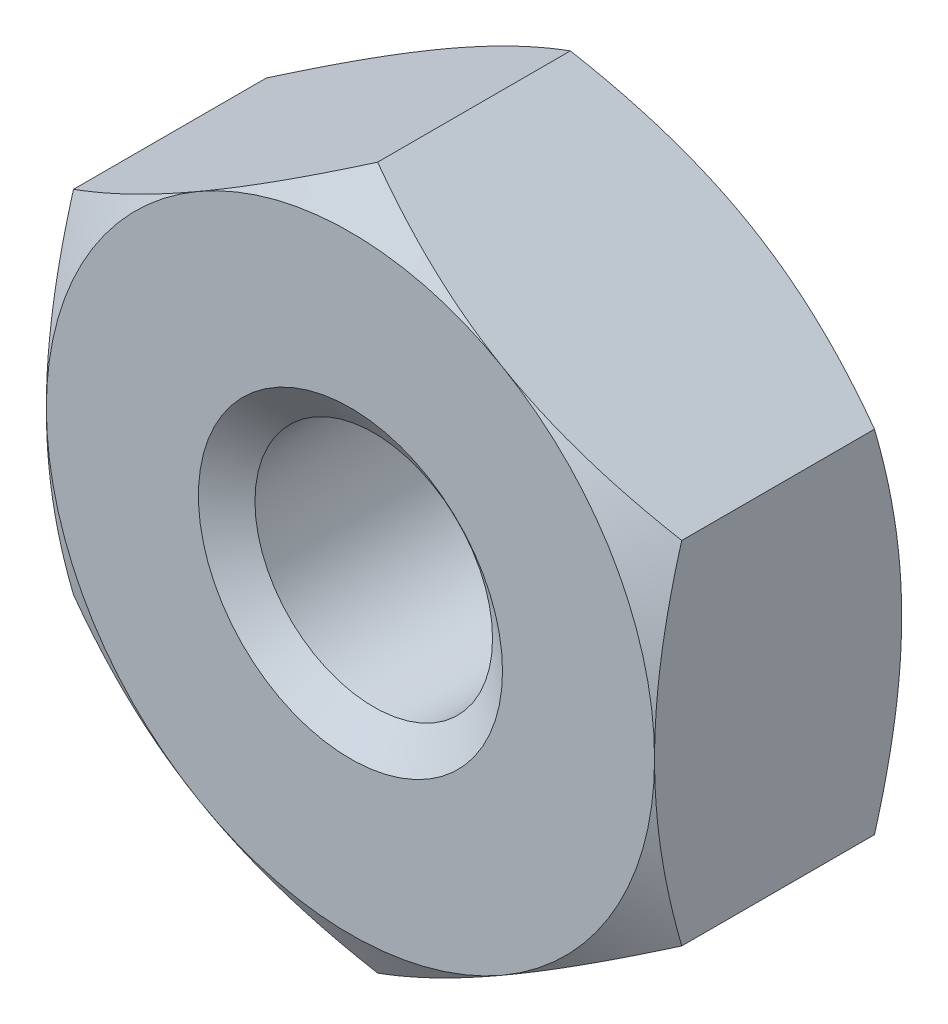
ISO-10303-21;
HEADER;
FILE_DESCRIPTION(('STEP AP214'),'2;1');
FILE_NAME('part.step','',(''),(''),'','','');
FILE_SCHEMA(('AUTOMOTIVE_DESIGN { 1 0 10303 214 1 1 1 1 }'));
ENDSEC;
DATA;
#1=APPLICATION_CONTEXT('core data for automotive mechanical design processes');
#2=APPLICATION_PROTOCOL_DEFINITION('international standard','automotive_design',2000,#1);
#3=PRODUCT_CONTEXT('',#1,'mechanical');
#4=PRODUCT('Part','Part','',(#3));
#5=PRODUCT_RELATED_PRODUCT_CATEGORY('part','',(#4));
#6=PRODUCT_DEFINITION_FORMATION('','',#4);
#7=PRODUCT_DEFINITION_CONTEXT('part definition',#1,'design');
#8=PRODUCT_DEFINITION('design','',#6,#7);
#9=PRODUCT_DEFINITION_SHAPE('','',#8);
#10=(LENGTH_UNIT() NAMED_UNIT(*) SI_UNIT(.MILLI.,.METRE.));
#11=(NAMED_UNIT(*) PLANE_ANGLE_UNIT() SI_UNIT($,.RADIAN.));
#12=(NAMED_UNIT(*) SI_UNIT($,.STERADIAN.) SOLID_ANGLE_UNIT());
#13=UNCERTAINTY_MEASURE_WITH_UNIT(LENGTH_MEASURE(1.E-05),#10,'distance_accuracy_value','');
#14=(GEOMETRIC_REPRESENTATION_CONTEXT(3) GLOBAL_UNCERTAINTY_ASSIGNED_CONTEXT((#13)) GLOBAL_UNIT_ASSIGNED_CONTEXT((#10,
#11,#12)) REPRESENTATION_CONTEXT('',''));
#15=CARTESIAN_POINT('',(0.,0.,0.));
#16=DIRECTION('',(0.,0.,1.));
#17=DIRECTION('',(1.,0.,0.));
#18=AXIS2_PLACEMENT_3D('',#15,#16,#17);
#19=CARTESIAN_POINT('',(0.,0.,-1.3));
#20=DIRECTION('',(0.,0.,1.));
#21=DIRECTION('',(1.,0.,0.));
#22=AXIS2_PLACEMENT_3D('',#19,#20,#21);
#23=CYLINDRICAL_SURFACE('',#22,0.625);
#24=CARTESIAN_POINT('',(0.,0.,-0.122536319186698));
#25=DIRECTION('',(0.,0.,1.));
#26=DIRECTION('',(1.,0.,0.));
#27=AXIS2_PLACEMENT_3D('',#24,#25,#26);
#28=CIRCLE('',#27,0.625);
#29=CARTESIAN_POINT('',(0.625,0.,-0.122536319186698));
#30=VERTEX_POINT('',#29);
#31=EDGE_CURVE('E177',#30,#30,#28,.F.);
#32=ORIENTED_EDGE('',*,*,#31,.F.);
#33=EDGE_LOOP('',(#32));
#34=FACE_BOUND('',#33,.T.);
#35=CARTESIAN_POINT('',(0.,0.,-1.1520636808133));
#36=DIRECTION('',(0.,0.,-1.));
#37=DIRECTION('',(-1.,0.,0.));
#38=AXIS2_PLACEMENT_3D('',#35,#36,#37);
#39=CIRCLE('',#38,0.625);
#40=CARTESIAN_POINT('',(-0.625,0.,-1.1520636808133));
#41=VERTEX_POINT('',#40);
#42=EDGE_CURVE('E41',#41,#41,#39,.F.);
#43=ORIENTED_EDGE('',*,*,#42,.F.);
#44=EDGE_LOOP('',(#43));
#45=FACE_BOUND('',#44,.T.);
#46=ADVANCED_FACE('F36',(#34,#45),#23,.F.);
#47=CARTESIAN_POINT('',(0.,1.84752086140681,-1.3));
#48=DIRECTION('',(-0.500000000000002,0.866025403784438,0.));
#49=DIRECTION('',(-0.866025403784438,-0.500000000000002,0.));
#50=AXIS2_PLACEMENT_3D('',#47,#48,#49);
#51=PLANE('',#50);
#52=DIRECTION('',(0.,0.,1.));
#53=VECTOR('',#52,1.);
#54=CARTESIAN_POINT('',(-1.6,0.9237604307034,-1.3));
#55=LINE('',#54,#53);
#56=CARTESIAN_POINT('',(-1.6,0.923760430703407,-1.15709376403673));
#57=VERTEX_POINT('',#56);
#58=CARTESIAN_POINT('',(-1.6,0.9237604307034,-0.142906235963266));
#59=VERTEX_POINT('',#58);
#60=EDGE_CURVE('E167',#57,#59,#55,.T.);
#61=ORIENTED_EDGE('',*,*,#60,.T.);
#62=CARTESIAN_POINT('',(-1.6002,0.923644960649562,-0.142972908879542));
#63=CARTESIAN_POINT('',(-1.52988631454261,0.9642405858761,-0.11952386935105));
#64=CARTESIAN_POINT('',(-1.45896568981644,1.00518662765285,-0.0981973588558104));
#65=CARTESIAN_POINT('',(-1.31589622208532,1.08778782336023,-0.0609706558641362));
#66=CARTESIAN_POINT('',(-1.24374483580213,1.12944444565323,-0.0450836346469227));
#67=CARTESIAN_POINT('',(-1.10033630057878,1.21224140206853,-0.0203517145647478));
#68=CARTESIAN_POINT('',(-1.02910122444319,1.25336899245115,-0.0113422364016105));
#69=CARTESIAN_POINT('',(-0.886295665767103,1.33581782019457,-0.000584271243997199));
#70=CARTESIAN_POINT('',(-0.814725702734542,1.37713875761731,0.00117312160481502));
#71=CARTESIAN_POINT('',(-0.680978543862273,1.45435771579556,-0.00247117305863181));
#72=CARTESIAN_POINT('',(-0.618781387401735,1.49026726082088,-0.0069780590876114));
#73=CARTESIAN_POINT('',(-0.494792313483936,1.5618523860239,-0.021265876193809));
#74=CARTESIAN_POINT('',(-0.433000825294996,1.59752771836341,-0.0310516940962129));
#75=CARTESIAN_POINT('',(-0.308755841646641,1.66926059311825,-0.0555169113294946));
#76=CARTESIAN_POINT('',(-0.246318081755429,1.70530905059904,-0.07030007992286));
#77=CARTESIAN_POINT('',(-0.122374128162257,1.77686812557048,-0.103852607783291));
#78=CARTESIAN_POINT('',(-0.0608663449577958,1.81237966076083,-0.122614076743966));
#79=CARTESIAN_POINT('',(0.000200000000000133,1.84763633146064,-0.142972908879544));
#80=B_SPLINE_CURVE_WITH_KNOTS('',3,(#62,#63,#64,#65,#66,#67,#68,#69,#70,#71,#72,#73,#74,#75,#76,
#77,#78,#79),.UNSPECIFIED.,.F.,.F.,(4,2,2,2,2,2,2,2,4),(0.,0.253628622662481,0.507867113505243,
0.755812447259193,1.0034532033284,1.21912891721902,1.43500463041921,1.65567058644228,
1.87590291418786),.UNSPECIFIED.);
#81=CARTESIAN_POINT('',(-0.800000000000003,1.3856406460551,0.));
#82=VERTEX_POINT('',#81);
#83=EDGE_CURVE('E63',#59,#82,#80,.T.);
#84=ORIENTED_EDGE('',*,*,#83,.T.);
#85=CARTESIAN_POINT('',(0.,1.84752086140681,-0.142906235963268));
#86=VERTEX_POINT('',#85);
#87=EDGE_CURVE('E246',#82,#86,#80,.T.);
#88=ORIENTED_EDGE('',*,*,#87,.T.);
#89=DIRECTION('',(0.,0.,1.));
#90=VECTOR('',#89,1.);
#91=CARTESIAN_POINT('',(0.,1.84752086140681,-1.3));
#92=LINE('',#91,#90);
#93=CARTESIAN_POINT('',(0.,1.84752086140681,-1.15709376403673));
#94=VERTEX_POINT('',#93);
#95=EDGE_CURVE('E152',#94,#86,#92,.T.);
#96=ORIENTED_EDGE('',*,*,#95,.F.);
#97=CARTESIAN_POINT('',(-1.6002,0.923644960649562,-1.15702709112046));
#98=CARTESIAN_POINT('',(-1.52988631454261,0.9642405858761,-1.18047613064895));
#99=CARTESIAN_POINT('',(-1.45896568981644,1.00518662765285,-1.20180264114419));
#100=CARTESIAN_POINT('',(-1.31589622208532,1.08778782336023,-1.23902934413586));
#101=CARTESIAN_POINT('',(-1.24374483580213,1.12944444565323,-1.25491636535308));
#102=CARTESIAN_POINT('',(-1.10033630057878,1.21224140206853,-1.27964828543525));
#103=CARTESIAN_POINT('',(-1.02910122444319,1.25336899245115,-1.28865776359839));
#104=CARTESIAN_POINT('',(-0.886295665767103,1.33581782019457,-1.299415728756));
#105=CARTESIAN_POINT('',(-0.814725702734541,1.37713875761731,-1.30117312160482));
#106=CARTESIAN_POINT('',(-0.680978543862273,1.45435771579556,-1.29752882694137));
#107=CARTESIAN_POINT('',(-0.618781387401735,1.49026726082088,-1.29302194091239));
#108=CARTESIAN_POINT('',(-0.494792313483936,1.5618523860239,-1.27873412380619));
#109=CARTESIAN_POINT('',(-0.433000825294996,1.59752771836341,-1.26894830590379));
#110=CARTESIAN_POINT('',(-0.308755841646641,1.66926059311825,-1.24448308867051));
#111=CARTESIAN_POINT('',(-0.246318081755429,1.70530905059904,-1.22969992007714));
#112=CARTESIAN_POINT('',(-0.122374128162257,1.77686812557048,-1.19614739221671));
#113=CARTESIAN_POINT('',(-0.0608663449577957,1.81237966076083,-1.17738592325603));
#114=CARTESIAN_POINT('',(0.00019999999999997,1.84763633146064,-1.15702709112046));
#115=B_SPLINE_CURVE_WITH_KNOTS('',3,(#97,#98,#99,#100,#101,#102,#103,#104,#105,#106,#107,#108,
#109,#110,#111,#112,#113,#114),.UNSPECIFIED.,.F.,.F.,(4,2,2,2,2,2,2,2,4),(0.,0.25362862266248,
0.507867113505243,0.755812447259193,1.00345320332839,1.21912891721902,1.43500463041921,
1.65567058644228,1.87590291418786),.UNSPECIFIED.);
#116=CARTESIAN_POINT('',(-0.800000000000003,1.3856406460551,-1.3));
#117=VERTEX_POINT('',#116);
#118=EDGE_CURVE('E170',#117,#94,#115,.T.);
#119=ORIENTED_EDGE('',*,*,#118,.F.);
#120=EDGE_CURVE('E269',#57,#117,#115,.T.);
#121=ORIENTED_EDGE('',*,*,#120,.F.);
#122=EDGE_LOOP('',(#61,#84,#88,#96,#119,#121));
#123=FACE_BOUND('',#122,.T.);
#124=ADVANCED_FACE('F38',(#123),#51,.T.);
#125=CARTESIAN_POINT('',(1.6,0.923760430703399,-1.3));
#126=DIRECTION('',(0.500000000000002,0.866025403784437,0.));
#127=DIRECTION('',(-0.866025403784437,0.500000000000002,0.));
#128=AXIS2_PLACEMENT_3D('',#125,#126,#127);
#129=PLANE('',#128);
#130=ORIENTED_EDGE('',*,*,#95,.T.);
#131=CARTESIAN_POINT('',(-0.000199999999999719,1.84763633146064,-0.142972908879544));
#132=CARTESIAN_POINT('',(0.0701136854573882,1.80704070623411,-0.119523869351051));
#133=CARTESIAN_POINT('',(0.14103431018356,1.76609466445735,-0.0981973588558121));
#134=CARTESIAN_POINT('',(0.284103777914678,1.68349346874998,-0.0609706558641375));
#135=CARTESIAN_POINT('',(0.356255164197867,1.64183684645697,-0.0450836346469238));
#136=CARTESIAN_POINT('',(0.499663699421224,1.55903989004168,-0.0203517145647484));
#137=CARTESIAN_POINT('',(0.570898775556808,1.51791229965905,-0.0113422364016109));
#138=CARTESIAN_POINT('',(0.713704334232898,1.43546347191564,-0.000584271243997234));
#139=CARTESIAN_POINT('',(0.78527429726546,1.3941425344929,0.0011731216048152));
#140=CARTESIAN_POINT('',(0.919021456137728,1.31692357631464,-0.00247117305863137));
#141=CARTESIAN_POINT('',(0.981218612598266,1.28101403128932,-0.00697805908761087));
#142=CARTESIAN_POINT('',(1.10520768651606,1.20942890608631,-0.0212658761938082));
#143=CARTESIAN_POINT('',(1.166999174705,1.1737535737468,-0.0310516940962118));
#144=CARTESIAN_POINT('',(1.29124415835336,1.10202069899196,-0.0555169113294932));
#145=CARTESIAN_POINT('',(1.35368191824457,1.06597224151117,-0.0703000799228585));
#146=CARTESIAN_POINT('',(1.47762587183774,0.994413166539724,-0.103852607783289));
#147=CARTESIAN_POINT('',(1.5391336550422,0.958901631349371,-0.122614076743964));
#148=CARTESIAN_POINT('',(1.6002,0.923644960649561,-0.142972908879541));
#149=B_SPLINE_CURVE_WITH_KNOTS('',3,(#131,#132,#133,#134,#135,#136,#137,#138,#139,#140,#141,
#142,#143,#144,#145,#146,#147,#148),.UNSPECIFIED.,.F.,.F.,(4,2,2,2,2,2,2,2,4),(0.,
0.253628622662481,0.507867113505244,0.755812447259195,1.0034532033284,1.21912891721902,
1.43500463041921,1.65567058644228,1.87590291418786),.UNSPECIFIED.);
#150=CARTESIAN_POINT('',(0.800000000000003,1.3856406460551,0.));
#151=VERTEX_POINT('',#150);
#152=EDGE_CURVE('E145',#86,#151,#149,.T.);
#153=ORIENTED_EDGE('',*,*,#152,.T.);
#154=CARTESIAN_POINT('',(1.6,0.923760430703407,-0.142906235963268));
#155=VERTEX_POINT('',#154);
#156=EDGE_CURVE('E131',#151,#155,#149,.T.);
#157=ORIENTED_EDGE('',*,*,#156,.T.);
#158=DIRECTION('',(0.,0.,1.));
#159=VECTOR('',#158,1.);
#160=CARTESIAN_POINT('',(1.6,0.923760430703399,-1.3));
#161=LINE('',#160,#159);
#162=CARTESIAN_POINT('',(1.6,0.923760430703407,-1.15709376403673));
#163=VERTEX_POINT('',#162);
#164=EDGE_CURVE('E144',#163,#155,#161,.T.);
#165=ORIENTED_EDGE('',*,*,#164,.F.);
#166=CARTESIAN_POINT('',(-0.000199999999999719,1.84763633146064,-1.15702709112046));
#167=CARTESIAN_POINT('',(0.0701136854573882,1.80704070623411,-1.18047613064895));
#168=CARTESIAN_POINT('',(0.14103431018356,1.76609466445735,-1.20180264114419));
#169=CARTESIAN_POINT('',(0.284103777914678,1.68349346874998,-1.23902934413586));
#170=CARTESIAN_POINT('',(0.356255164197867,1.64183684645697,-1.25491636535308));
#171=CARTESIAN_POINT('',(0.499663699421224,1.55903989004168,-1.27964828543525));
#172=CARTESIAN_POINT('',(0.570898775556808,1.51791229965905,-1.28865776359839));
#173=CARTESIAN_POINT('',(0.713704334232898,1.43546347191564,-1.299415728756));
#174=CARTESIAN_POINT('',(0.78527429726546,1.3941425344929,-1.30117312160482));
#175=CARTESIAN_POINT('',(0.919021456137728,1.31692357631464,-1.29752882694137));
#176=CARTESIAN_POINT('',(0.981218612598266,1.28101403128932,-1.29302194091239));
#177=CARTESIAN_POINT('',(1.10520768651606,1.20942890608631,-1.27873412380619));
#178=CARTESIAN_POINT('',(1.166999174705,1.1737535737468,-1.26894830590379));
#179=CARTESIAN_POINT('',(1.29124415835336,1.10202069899196,-1.24448308867051));
#180=CARTESIAN_POINT('',(1.35368191824457,1.06597224151117,-1.22969992007714));
#181=CARTESIAN_POINT('',(1.47762587183774,0.994413166539724,-1.19614739221671));
#182=CARTESIAN_POINT('',(1.5391336550422,0.958901631349371,-1.17738592325604));
#183=CARTESIAN_POINT('',(1.6002,0.923644960649561,-1.15702709112046));
#184=B_SPLINE_CURVE_WITH_KNOTS('',3,(#166,#167,#168,#169,#170,#171,#172,#173,#174,#175,#176,
#177,#178,#179,#180,#181,#182,#183),.UNSPECIFIED.,.F.,.F.,(4,2,2,2,2,2,2,2,4),(0.,
0.253628622662481,0.507867113505244,0.755812447259195,1.0034532033284,1.21912891721902,
1.43500463041921,1.65567058644228,1.87590291418786),.UNSPECIFIED.);
#185=CARTESIAN_POINT('',(0.800000000000003,1.3856406460551,-1.3));
#186=VERTEX_POINT('',#185);
#187=EDGE_CURVE('E262',#186,#163,#184,.T.);
#188=ORIENTED_EDGE('',*,*,#187,.F.);
#189=EDGE_CURVE('E268',#94,#186,#184,.T.);
#190=ORIENTED_EDGE('',*,*,#189,.F.);
#191=EDGE_LOOP('',(#130,#153,#157,#165,#188,#190));
#192=FACE_BOUND('',#191,.T.);
#193=ADVANCED_FACE('F142',(#192),#129,.T.);
#194=CARTESIAN_POINT('',(1.6,0.923760430703399,-1.3));
#195=DIRECTION('',(-1.,0.,0.));
#196=DIRECTION('',(0.,0.,1.));
#197=AXIS2_PLACEMENT_3D('',#194,#195,#196);
#198=PLANE('',#197);
#199=CARTESIAN_POINT('',(1.6,-2.44994879598357,-0.765642728496259));
#200=CARTESIAN_POINT('',(1.6,-2.37969974814163,-0.731694508327918));
#201=CARTESIAN_POINT('',(1.6,-2.30928460837461,-0.698083761533541));
#202=CARTESIAN_POINT('',(1.6,-2.16803233911836,-0.631730058708288));
#203=CARTESIAN_POINT('',(1.6,-2.09719513913279,-0.598987252925733));
#204=CARTESIAN_POINT('',(1.6,-1.95462628673218,-0.534389785244709));
#205=CARTESIAN_POINT('',(1.6,-1.8828918355113,-0.502541278099893));
#206=CARTESIAN_POINT('',(1.6,-1.73883333903521,-0.44021223409345));
#207=CARTESIAN_POINT('',(1.6,-1.6665093247456,-0.409731625925813));
#208=CARTESIAN_POINT('',(1.6,-1.52025911131041,-0.350140376362839));
#209=CARTESIAN_POINT('',(1.6,-1.44632414246222,-0.321051139719715));
#210=CARTESIAN_POINT('',(1.6,-1.29758156645315,-0.265150698697263));
#211=CARTESIAN_POINT('',(1.6,-1.22277385663729,-0.238339765436293));
#212=CARTESIAN_POINT('',(1.6,-1.07232436571228,-0.187717744432215));
#213=CARTESIAN_POINT('',(1.6,-0.996684796742377,-0.16390014938712));
#214=CARTESIAN_POINT('',(1.6,-0.844324154022591,-0.120034982590466));
#215=CARTESIAN_POINT('',(1.6,-0.767603338043493,-0.0999865280833133));
#216=CARTESIAN_POINT('',(1.6,-0.613036885171955,-0.0646363619078523));
#217=CARTESIAN_POINT('',(1.6,-0.535190999347726,-0.0493357180986316));
#218=CARTESIAN_POINT('',(1.6,-0.378561259128046,-0.0245095306527775));
#219=CARTESIAN_POINT('',(1.6,-0.299777403903375,-0.014983992122063));
#220=CARTESIAN_POINT('',(1.6,-0.142180170377903,-0.00255333229477223));
#221=CARTESIAN_POINT('',(1.6,-0.0633701971665525,0.000393701552479175));
#222=CARTESIAN_POINT('',(1.6,0.094186507576113,-0.000479368384373142));
#223=CARTESIAN_POINT('',(1.6,0.172933250213998,-0.00429771555629648));
#224=CARTESIAN_POINT('',(1.6,0.363437778602548,-0.0213794511304662));
#225=CARTESIAN_POINT('',(1.6,0.474896382255892,-0.0379863535114732));
#226=CARTESIAN_POINT('',(1.6,0.695751445002752,-0.0817595954163211));
#227=CARTESIAN_POINT('',(1.6,0.805145318543973,-0.108938358499321));
#228=CARTESIAN_POINT('',(1.6,0.968869652923254,-0.15580715652431));
#229=CARTESIAN_POINT('',(1.6,1.02403724151603,-0.172685741626058));
#230=CARTESIAN_POINT('',(1.6,1.13379353971654,-0.208113667302656));
#231=CARTESIAN_POINT('',(1.6,1.18838261996598,-0.226661855504924));
#232=CARTESIAN_POINT('',(1.6,1.29675750604283,-0.265042326377577));
#233=CARTESIAN_POINT('',(1.6,1.35054610375004,-0.284866793658882));
#234=CARTESIAN_POINT('',(1.6,1.45770597270107,-0.325679318149291));
#235=CARTESIAN_POINT('',(1.6,1.51107706518851,-0.346667845641859));
#236=CARTESIAN_POINT('',(1.6,1.56425479594673,-0.368123602616716));
#237=B_SPLINE_CURVE_WITH_KNOTS('',3,(#199,#200,#201,#202,#203,#204,#205,#206,#207,#208,#209,
#210,#211,#212,#213,#214,#215,#216,#217,#218,#219,#220,#221,#222,#223,#224,#225,#226,#227,#228,
#229,#230,#231,#232,#233,#234,#235,#236),.UNSPECIFIED.,.F.,.F.,(4,2,2,2,2,2,2,2,2,2,2,2,2,2,2,2,
2,2,4),(0.,0.234068717012908,0.468177692239707,0.703626378583959,0.939062777139307,
1.17738868236875,1.41574290880726,1.65356966173644,1.89134064461681,2.12916506732231,
2.36698970029418,2.60329474246707,2.83953843769047,3.1769134235551,3.51468608047105,
3.68774124262249,3.86067786349693,4.03264108088362,4.20467428524161),.UNSPECIFIED.);
#238=CARTESIAN_POINT('',(1.6,-0.923760430703406,-0.142906235963268));
#239=VERTEX_POINT('',#238);
#240=CARTESIAN_POINT('',(1.6,0.,0.));
#241=VERTEX_POINT('',#240);
#242=EDGE_CURVE('E137',#239,#241,#237,.T.);
#243=ORIENTED_EDGE('',*,*,#242,.F.);
#244=DIRECTION('',(0.,0.,1.));
#245=VECTOR('',#244,1.);
#246=CARTESIAN_POINT('',(1.6,-0.923760430703406,-1.3));
#247=LINE('',#246,#245);
#248=CARTESIAN_POINT('',(1.6,-0.923760430703406,-1.15709376403673));
#249=VERTEX_POINT('',#248);
#250=EDGE_CURVE('E153',#249,#239,#247,.T.);
#251=ORIENTED_EDGE('',*,*,#250,.F.);
#252=CARTESIAN_POINT('',(1.6,-2.44994879598357,-0.53435727150374));
#253=CARTESIAN_POINT('',(1.6,-2.37969974814163,-0.568305491672082));
#254=CARTESIAN_POINT('',(1.6,-2.30928460837461,-0.601916238466459));
#255=CARTESIAN_POINT('',(1.6,-2.16803233911836,-0.668269941291711));
#256=CARTESIAN_POINT('',(1.6,-2.09719513913279,-0.701012747074267));
#257=CARTESIAN_POINT('',(1.6,-1.95462628673218,-0.765610214755291));
#258=CARTESIAN_POINT('',(1.6,-1.8828918355113,-0.797458721900106));
#259=CARTESIAN_POINT('',(1.6,-1.73883333903521,-0.85978776590655));
#260=CARTESIAN_POINT('',(1.6,-1.6665093247456,-0.890268374074187));
#261=CARTESIAN_POINT('',(1.6,-1.52025911131041,-0.94985962363716));
#262=CARTESIAN_POINT('',(1.6,-1.44632414246222,-0.978948860280285));
#263=CARTESIAN_POINT('',(1.6,-1.29758156645315,-1.03484930130274));
#264=CARTESIAN_POINT('',(1.6,-1.22277385663729,-1.06166023456371));
#265=CARTESIAN_POINT('',(1.6,-1.07232436571228,-1.11228225556778));
#266=CARTESIAN_POINT('',(1.6,-0.996684796742377,-1.13609985061288));
#267=CARTESIAN_POINT('',(1.6,-0.844324154022591,-1.17996501740953));
#268=CARTESIAN_POINT('',(1.6,-0.767603338043493,-1.20001347191669));
#269=CARTESIAN_POINT('',(1.6,-0.613036885171955,-1.23536363809215));
#270=CARTESIAN_POINT('',(1.6,-0.535190999347727,-1.25066428190137));
#271=CARTESIAN_POINT('',(1.6,-0.378561259128047,-1.27549046934722));
#272=CARTESIAN_POINT('',(1.6,-0.299777403903376,-1.28501600787794));
#273=CARTESIAN_POINT('',(1.6,-0.142180170377903,-1.29744666770523));
#274=CARTESIAN_POINT('',(1.6,-0.0633701971665525,-1.30039370155248));
#275=CARTESIAN_POINT('',(1.6,0.0941865075761131,-1.29952063161563));
#276=CARTESIAN_POINT('',(1.6,0.172933250213998,-1.2957022844437));
#277=CARTESIAN_POINT('',(1.6,0.363437778602548,-1.27862054886953));
#278=CARTESIAN_POINT('',(1.6,0.474896382255892,-1.26201364648853));
#279=CARTESIAN_POINT('',(1.6,0.695751445002752,-1.21824040458368));
#280=CARTESIAN_POINT('',(1.6,0.805145318543973,-1.19106164150068));
#281=CARTESIAN_POINT('',(1.6,0.968869652923254,-1.14419284347569));
#282=CARTESIAN_POINT('',(1.6,1.02403724151603,-1.12731425837394));
#283=CARTESIAN_POINT('',(1.6,1.13379353971654,-1.09188633269734));
#284=CARTESIAN_POINT('',(1.6,1.18838261996598,-1.07333814449508));
#285=CARTESIAN_POINT('',(1.6,1.29675750604283,-1.03495767362242));
#286=CARTESIAN_POINT('',(1.6,1.35054610375004,-1.01513320634112));
#287=CARTESIAN_POINT('',(1.6,1.45770597270107,-0.974320681850709));
#288=CARTESIAN_POINT('',(1.6,1.51107706518851,-0.953332154358141));
#289=CARTESIAN_POINT('',(1.6,1.56425479594673,-0.931876397383284));
#290=B_SPLINE_CURVE_WITH_KNOTS('',3,(#252,#253,#254,#255,#256,#257,#258,#259,#260,#261,#262,
#263,#264,#265,#266,#267,#268,#269,#270,#271,#272,#273,#274,#275,#276,#277,#278,#279,#280,#281,
#282,#283,#284,#285,#286,#287,#288,#289),.UNSPECIFIED.,.F.,.F.,(4,2,2,2,2,2,2,2,2,2,2,2,2,2,2,2,
2,2,4),(0.,0.234068717012908,0.468177692239707,0.703626378583959,0.939062777139307,
1.17738868236875,1.41574290880726,1.65356966173644,1.89134064461681,2.1291650673223,
2.36698970029418,2.60329474246707,2.83953843769047,3.17691342355509,3.51468608047105,
3.68774124262249,3.86067786349692,4.03264108088362,4.20467428524161),.UNSPECIFIED.);
#291=CARTESIAN_POINT('',(1.6,0.,-1.3));
#292=VERTEX_POINT('',#291);
#293=EDGE_CURVE('E275',#249,#292,#290,.T.);
#294=ORIENTED_EDGE('',*,*,#293,.T.);
#295=EDGE_CURVE('E151',#292,#163,#290,.T.);
#296=ORIENTED_EDGE('',*,*,#295,.T.);
#297=ORIENTED_EDGE('',*,*,#164,.T.);
#298=EDGE_CURVE('E128',#241,#155,#237,.T.);
#299=ORIENTED_EDGE('',*,*,#298,.F.);
#300=EDGE_LOOP('',(#243,#251,#294,#296,#297,#299));
#301=FACE_BOUND('',#300,.T.);
#302=ADVANCED_FACE('F148',(#301),#198,.F.);
#303=CARTESIAN_POINT('',(0.,-1.84752086140681,-1.3));
#304=DIRECTION('',(0.500000000000002,-0.866025403784438,0.));
#305=DIRECTION('',(0.866025403784438,0.500000000000002,0.));
#306=AXIS2_PLACEMENT_3D('',#303,#304,#305);
#307=PLANE('',#306);
#308=ORIENTED_EDGE('',*,*,#250,.T.);
#309=CARTESIAN_POINT('',(1.6002,-0.923644960649568,-0.142972908879543));
#310=CARTESIAN_POINT('',(1.52988631454261,-0.964240585876105,-0.119523869351051));
#311=CARTESIAN_POINT('',(1.45896568981644,-1.00518662765286,-0.0981973588558121));
#312=CARTESIAN_POINT('',(1.31589622208532,-1.08778782336023,-0.0609706558641381));
#313=CARTESIAN_POINT('',(1.24374483580213,-1.12944444565324,-0.0450836346469248));
#314=CARTESIAN_POINT('',(1.10033630057878,-1.21224140206853,-0.0203517145647502));
#315=CARTESIAN_POINT('',(1.02910122444319,-1.25336899245116,-0.011342236401613));
#316=CARTESIAN_POINT('',(0.886295665767102,-1.33581782019457,-0.000584271243999939));
#317=CARTESIAN_POINT('',(0.81472570273454,-1.37713875761732,0.00117312160481225));
#318=CARTESIAN_POINT('',(0.680978543862272,-1.45435771579557,-0.00247117305863489));
#319=CARTESIAN_POINT('',(0.618781387401734,-1.49026726082089,-0.00697805908761471));
#320=CARTESIAN_POINT('',(0.494792313483935,-1.5618523860239,-0.0212658761938125));
#321=CARTESIAN_POINT('',(0.433000825294995,-1.59752771836341,-0.0310516940962164));
#322=CARTESIAN_POINT('',(0.30875584164664,-1.66926059311825,-0.0555169113294982));
#323=CARTESIAN_POINT('',(0.246318081755429,-1.70530905059904,-0.0703000799228637));
#324=CARTESIAN_POINT('',(0.122374128162257,-1.77686812557049,-0.103852607783295));
#325=CARTESIAN_POINT('',(0.0608663449577954,-1.81237966076084,-0.122614076743969));
#326=CARTESIAN_POINT('',(-0.00020000000000018,-1.84763633146065,-0.142972908879547));
#327=B_SPLINE_CURVE_WITH_KNOTS('',3,(#309,#310,#311,#312,#313,#314,#315,#316,#317,#318,#319,
#320,#321,#322,#323,#324,#325,#326),.UNSPECIFIED.,.F.,.F.,(4,2,2,2,2,2,2,2,4),(0.,
0.253628622662481,0.507867113505244,0.755812447259194,1.0034532033284,1.21912891721902,
1.43500463041921,1.65567058644228,1.87590291418786),.UNSPECIFIED.);
#328=CARTESIAN_POINT('',(0.800000000000003,-1.3856406460551,0.));
#329=VERTEX_POINT('',#328);
#330=EDGE_CURVE('E550',#239,#329,#327,.T.);
#331=ORIENTED_EDGE('',*,*,#330,.T.);
#332=CARTESIAN_POINT('',(0.,-1.84752086140681,-0.142906235963268));
#333=VERTEX_POINT('',#332);
#334=EDGE_CURVE('E230',#329,#333,#327,.T.);
#335=ORIENTED_EDGE('',*,*,#334,.T.);
#336=DIRECTION('',(0.,0.,1.));
#337=VECTOR('',#336,1.);
#338=CARTESIAN_POINT('',(0.,-1.84752086140681,-1.3));
#339=LINE('',#338,#337);
#340=CARTESIAN_POINT('',(0.,-1.84752086140681,-1.15709376403673));
#341=VERTEX_POINT('',#340);
#342=EDGE_CURVE('E158',#341,#333,#339,.T.);
#343=ORIENTED_EDGE('',*,*,#342,.F.);
#344=CARTESIAN_POINT('',(1.6002,-0.923644960649568,-1.15702709112046));
#345=CARTESIAN_POINT('',(1.52988631454261,-0.964240585876105,-1.18047613064895));
#346=CARTESIAN_POINT('',(1.45896568981644,-1.00518662765286,-1.20180264114419));
#347=CARTESIAN_POINT('',(1.31589622208532,-1.08778782336024,-1.23902934413586));
#348=CARTESIAN_POINT('',(1.24374483580213,-1.12944444565324,-1.25491636535308));
#349=CARTESIAN_POINT('',(1.10033630057878,-1.21224140206854,-1.27964828543525));
#350=CARTESIAN_POINT('',(1.02910122444319,-1.25336899245116,-1.28865776359839));
#351=CARTESIAN_POINT('',(0.886295665767102,-1.33581782019457,-1.299415728756));
#352=CARTESIAN_POINT('',(0.81472570273454,-1.37713875761732,-1.30117312160481));
#353=CARTESIAN_POINT('',(0.680978543862272,-1.45435771579557,-1.29752882694136));
#354=CARTESIAN_POINT('',(0.618781387401734,-1.49026726082089,-1.29302194091239));
#355=CARTESIAN_POINT('',(0.494792313483935,-1.5618523860239,-1.27873412380619));
#356=CARTESIAN_POINT('',(0.433000825294995,-1.59752771836341,-1.26894830590378));
#357=CARTESIAN_POINT('',(0.30875584164664,-1.66926059311825,-1.2444830886705));
#358=CARTESIAN_POINT('',(0.246318081755429,-1.70530905059904,-1.22969992007714));
#359=CARTESIAN_POINT('',(0.122374128162257,-1.77686812557049,-1.19614739221671));
#360=CARTESIAN_POINT('',(0.0608663449577955,-1.81237966076084,-1.17738592325603));
#361=CARTESIAN_POINT('',(-0.000200000000000114,-1.84763633146065,-1.15702709112045));
#362=B_SPLINE_CURVE_WITH_KNOTS('',3,(#344,#345,#346,#347,#348,#349,#350,#351,#352,#353,#354,
#355,#356,#357,#358,#359,#360,#361),.UNSPECIFIED.,.F.,.F.,(4,2,2,2,2,2,2,2,4),(0.,
0.253628622662481,0.507867113505244,0.755812447259195,1.0034532033284,1.21912891721902,
1.43500463041921,1.65567058644228,1.87590291418786),.UNSPECIFIED.);
#363=CARTESIAN_POINT('',(0.800000000000003,-1.3856406460551,-1.3));
#364=VERTEX_POINT('',#363);
#365=EDGE_CURVE('E282',#364,#341,#362,.T.);
#366=ORIENTED_EDGE('',*,*,#365,.F.);
#367=EDGE_CURVE('E281',#249,#364,#362,.T.);
#368=ORIENTED_EDGE('',*,*,#367,.F.);
#369=EDGE_LOOP('',(#308,#331,#335,#343,#366,#368));
#370=FACE_BOUND('',#369,.T.);
#371=ADVANCED_FACE('F294',(#370),#307,.T.);
#372=CARTESIAN_POINT('',(-1.6,-0.923760430703405,-1.3));
#373=DIRECTION('',(-0.500000000000002,-0.866025403784437,0.));
#374=DIRECTION('',(0.866025403784437,-0.500000000000002,0.));
#375=AXIS2_PLACEMENT_3D('',#372,#373,#374);
#376=PLANE('',#375);
#377=ORIENTED_EDGE('',*,*,#342,.T.);
#378=CARTESIAN_POINT('',(0.000199999999999844,-1.84763633146065,-0.142972908879547));
#379=CARTESIAN_POINT('',(-0.0701136854573883,-1.80704070623411,-0.119523869351055));
#380=CARTESIAN_POINT('',(-0.14103431018356,-1.76609466445736,-0.0981973588558154));
#381=CARTESIAN_POINT('',(-0.284103777914678,-1.68349346874998,-0.0609706558641407));
#382=CARTESIAN_POINT('',(-0.356255164197868,-1.64183684645698,-0.045083634646927));
#383=CARTESIAN_POINT('',(-0.499663699421225,-1.55903989004168,-0.0203517145647515));
#384=CARTESIAN_POINT('',(-0.570898775556809,-1.51791229965906,-0.011342236401614));
#385=CARTESIAN_POINT('',(-0.7137043342329,-1.43546347191564,-0.000584271244000196));
#386=CARTESIAN_POINT('',(-0.785274297265462,-1.3941425344929,0.0011731216048123));
#387=CARTESIAN_POINT('',(-0.91902145613773,-1.31692357631465,-0.00247117305863422));
#388=CARTESIAN_POINT('',(-0.981218612598268,-1.28101403128933,-0.00697805908761371));
#389=CARTESIAN_POINT('',(-1.10520768651607,-1.20942890608631,-0.0212658761938109));
#390=CARTESIAN_POINT('',(-1.16699917470501,-1.1737535737468,-0.0310516940962144));
#391=CARTESIAN_POINT('',(-1.29124415835336,-1.10202069899196,-0.0555169113294956));
#392=CARTESIAN_POINT('',(-1.35368191824457,-1.06597224151117,-0.0703000799228608));
#393=CARTESIAN_POINT('',(-1.47762587183774,-0.99441316653973,-0.103852607783291));
#394=CARTESIAN_POINT('',(-1.5391336550422,-0.958901631349377,-0.122614076743966));
#395=CARTESIAN_POINT('',(-1.6002,-0.923644960649567,-0.142972908879543));
#396=B_SPLINE_CURVE_WITH_KNOTS('',3,(#378,#379,#380,#381,#382,#383,#384,#385,#386,#387,#388,
#389,#390,#391,#392,#393,#394,#395),.UNSPECIFIED.,.F.,.F.,(4,2,2,2,2,2,2,2,4),(0.,
0.253628622662482,0.507867113505246,0.755812447259197,1.0034532033284,1.21912891721902,
1.43500463041921,1.65567058644228,1.87590291418786),.UNSPECIFIED.);
#397=CARTESIAN_POINT('',(-0.800000000000004,-1.3856406460551,0.));
#398=VERTEX_POINT('',#397);
#399=EDGE_CURVE('E548',#333,#398,#396,.T.);
#400=ORIENTED_EDGE('',*,*,#399,.T.);
#401=CARTESIAN_POINT('',(-1.6,-0.923760430703407,-0.142906235963268));
#402=VERTEX_POINT('',#401);
#403=EDGE_CURVE('E202',#398,#402,#396,.T.);
#404=ORIENTED_EDGE('',*,*,#403,.T.);
#405=DIRECTION('',(0.,0.,1.));
#406=VECTOR('',#405,1.);
#407=CARTESIAN_POINT('',(-1.6,-0.923760430703405,-1.3));
#408=LINE('',#407,#406);
#409=CARTESIAN_POINT('',(-1.6,-0.923760430703407,-1.15709376403673));
#410=VERTEX_POINT('',#409);
#411=EDGE_CURVE('E164',#410,#402,#408,.T.);
#412=ORIENTED_EDGE('',*,*,#411,.F.);
#413=CARTESIAN_POINT('',(0.000199999999999844,-1.84763633146065,-1.15702709112045));
#414=CARTESIAN_POINT('',(-0.0701136854573883,-1.80704070623411,-1.18047613064895));
#415=CARTESIAN_POINT('',(-0.14103431018356,-1.76609466445736,-1.20180264114418));
#416=CARTESIAN_POINT('',(-0.284103777914678,-1.68349346874998,-1.23902934413586));
#417=CARTESIAN_POINT('',(-0.356255164197868,-1.64183684645698,-1.25491636535307));
#418=CARTESIAN_POINT('',(-0.499663699421226,-1.55903989004168,-1.27964828543525));
#419=CARTESIAN_POINT('',(-0.57089877555681,-1.51791229965906,-1.28865776359839));
#420=CARTESIAN_POINT('',(-0.7137043342329,-1.43546347191564,-1.299415728756));
#421=CARTESIAN_POINT('',(-0.785274297265462,-1.3941425344929,-1.30117312160481));
#422=CARTESIAN_POINT('',(-0.91902145613773,-1.31692357631465,-1.29752882694137));
#423=CARTESIAN_POINT('',(-0.981218612598268,-1.28101403128933,-1.29302194091239));
#424=CARTESIAN_POINT('',(-1.10520768651607,-1.20942890608631,-1.27873412380619));
#425=CARTESIAN_POINT('',(-1.16699917470501,-1.1737535737468,-1.26894830590379));
#426=CARTESIAN_POINT('',(-1.29124415835336,-1.10202069899196,-1.2444830886705));
#427=CARTESIAN_POINT('',(-1.35368191824457,-1.06597224151117,-1.22969992007714));
#428=CARTESIAN_POINT('',(-1.47762587183774,-0.99441316653973,-1.19614739221671));
#429=CARTESIAN_POINT('',(-1.5391336550422,-0.958901631349377,-1.17738592325603));
#430=CARTESIAN_POINT('',(-1.6002,-0.923644960649567,-1.15702709112046));
#431=B_SPLINE_CURVE_WITH_KNOTS('',3,(#413,#414,#415,#416,#417,#418,#419,#420,#421,#422,#423,
#424,#425,#426,#427,#428,#429,#430),.UNSPECIFIED.,.F.,.F.,(4,2,2,2,2,2,2,2,4),(0.,
0.253628622662482,0.507867113505246,0.755812447259197,1.0034532033284,1.21912891721902,
1.43500463041921,1.65567058644228,1.87590291418786),.UNSPECIFIED.);
#432=CARTESIAN_POINT('',(-0.800000000000004,-1.3856406460551,-1.3));
#433=VERTEX_POINT('',#432);
#434=EDGE_CURVE('E289',#433,#410,#431,.T.);
#435=ORIENTED_EDGE('',*,*,#434,.F.);
#436=EDGE_CURVE('E288',#341,#433,#431,.T.);
#437=ORIENTED_EDGE('',*,*,#436,.F.);
#438=EDGE_LOOP('',(#377,#400,#404,#412,#435,#437));
#439=FACE_BOUND('',#438,.T.);
#440=ADVANCED_FACE('F297',(#439),#376,.T.);
#441=CARTESIAN_POINT('',(-1.6,0.9237604307034,-1.3));
#442=DIRECTION('',(-1.,0.,0.));
#443=DIRECTION('',(0.,0.,1.));
#444=AXIS2_PLACEMENT_3D('',#441,#442,#443);
#445=PLANE('',#444);
#446=ORIENTED_EDGE('',*,*,#411,.T.);
#447=CARTESIAN_POINT('',(-1.6,-2.44994879598357,-0.765642728496259));
#448=CARTESIAN_POINT('',(-1.6,-2.37969974814163,-0.731694508327918));
#449=CARTESIAN_POINT('',(-1.6,-2.30928460837461,-0.698083761533541));
#450=CARTESIAN_POINT('',(-1.6,-2.16803233911836,-0.631730058708288));
#451=CARTESIAN_POINT('',(-1.6,-2.09719513913279,-0.598987252925733));
#452=CARTESIAN_POINT('',(-1.6,-1.95462628673218,-0.534389785244709));
#453=CARTESIAN_POINT('',(-1.6,-1.8828918355113,-0.502541278099893));
#454=CARTESIAN_POINT('',(-1.6,-1.73883333903521,-0.44021223409345));
#455=CARTESIAN_POINT('',(-1.6,-1.6665093247456,-0.409731625925813));
#456=CARTESIAN_POINT('',(-1.6,-1.52025911131041,-0.350140376362839));
#457=CARTESIAN_POINT('',(-1.6,-1.44632414246222,-0.321051139719716));
#458=CARTESIAN_POINT('',(-1.6,-1.29758156645315,-0.265150698697263));
#459=CARTESIAN_POINT('',(-1.6,-1.22277385663729,-0.238339765436293));
#460=CARTESIAN_POINT('',(-1.6,-1.07232436571228,-0.187717744432215));
#461=CARTESIAN_POINT('',(-1.6,-0.996684796742377,-0.16390014938712));
#462=CARTESIAN_POINT('',(-1.6,-0.844324154022591,-0.120034982590466));
#463=CARTESIAN_POINT('',(-1.6,-0.767603338043493,-0.0999865280833133));
#464=CARTESIAN_POINT('',(-1.6,-0.613036885171955,-0.0646363619078523));
#465=CARTESIAN_POINT('',(-1.6,-0.535190999347726,-0.0493357180986316));
#466=CARTESIAN_POINT('',(-1.6,-0.378561259128046,-0.0245095306527775));
#467=CARTESIAN_POINT('',(-1.6,-0.299777403903375,-0.014983992122063));
#468=CARTESIAN_POINT('',(-1.6,-0.142180170377903,-0.00255333229477224));
#469=CARTESIAN_POINT('',(-1.6,-0.0633701971665523,0.000393701552479173));
#470=CARTESIAN_POINT('',(-1.6,0.0941865075761133,-0.00047936838437314));
#471=CARTESIAN_POINT('',(-1.6,0.172933250213998,-0.00429771555629647));
#472=CARTESIAN_POINT('',(-1.6,0.363437778602548,-0.0213794511304662));
#473=CARTESIAN_POINT('',(-1.6,0.474896382255892,-0.0379863535114732));
#474=CARTESIAN_POINT('',(-1.6,0.695751445002752,-0.0817595954163211));
#475=CARTESIAN_POINT('',(-1.6,0.805145318543974,-0.108938358499322));
#476=CARTESIAN_POINT('',(-1.6,0.968869652923255,-0.15580715652431));
#477=CARTESIAN_POINT('',(-1.6,1.02403724151603,-0.172685741626058));
#478=CARTESIAN_POINT('',(-1.6,1.13379353971654,-0.208113667302656));
#479=CARTESIAN_POINT('',(-1.6,1.18838261996598,-0.226661855504924));
#480=CARTESIAN_POINT('',(-1.6,1.29675750604283,-0.265042326377577));
#481=CARTESIAN_POINT('',(-1.6,1.35054610375004,-0.284866793658882));
#482=CARTESIAN_POINT('',(-1.6,1.45770597270107,-0.325679318149292));
#483=CARTESIAN_POINT('',(-1.6,1.51107706518851,-0.34666784564186));
#484=CARTESIAN_POINT('',(-1.6,1.56425479594673,-0.368123602616717));
#485=B_SPLINE_CURVE_WITH_KNOTS('',3,(#447,#448,#449,#450,#451,#452,#453,#454,#455,#456,#457,
#458,#459,#460,#461,#462,#463,#464,#465,#466,#467,#468,#469,#470,#471,#472,#473,#474,#475,#476,
#477,#478,#479,#480,#481,#482,#483,#484),.UNSPECIFIED.,.F.,.F.,(4,2,2,2,2,2,2,2,2,2,2,2,2,2,2,2,
2,2,4),(0.,0.234068717012908,0.468177692239707,0.703626378583958,0.939062777139307,
1.17738868236874,1.41574290880726,1.65356966173644,1.89134064461681,2.1291650673223,
2.36698970029417,2.60329474246707,2.83953843769047,3.1769134235551,3.51468608047105,
3.68774124262249,3.86067786349692,4.03264108088362,4.20467428524161),.UNSPECIFIED.);
#486=CARTESIAN_POINT('',(-1.6,0.,0.));
#487=VERTEX_POINT('',#486);
#488=EDGE_CURVE('E201',#402,#487,#485,.T.);
#489=ORIENTED_EDGE('',*,*,#488,.T.);
#490=EDGE_CURVE('E194',#487,#59,#485,.T.);
#491=ORIENTED_EDGE('',*,*,#490,.T.);
#492=ORIENTED_EDGE('',*,*,#60,.F.);
#493=CARTESIAN_POINT('',(-1.6,-2.44994879598357,-0.534357271503741));
#494=CARTESIAN_POINT('',(-1.6,-2.37969974814163,-0.568305491672082));
#495=CARTESIAN_POINT('',(-1.6,-2.30928460837461,-0.601916238466459));
#496=CARTESIAN_POINT('',(-1.6,-2.16803233911836,-0.668269941291712));
#497=CARTESIAN_POINT('',(-1.6,-2.09719513913279,-0.701012747074267));
#498=CARTESIAN_POINT('',(-1.6,-1.95462628673218,-0.765610214755291));
#499=CARTESIAN_POINT('',(-1.6,-1.8828918355113,-0.797458721900107));
#500=CARTESIAN_POINT('',(-1.6,-1.73883333903521,-0.85978776590655));
#501=CARTESIAN_POINT('',(-1.6,-1.6665093247456,-0.890268374074187));
#502=CARTESIAN_POINT('',(-1.6,-1.52025911131041,-0.949859623637161));
#503=CARTESIAN_POINT('',(-1.6,-1.44632414246222,-0.978948860280285));
#504=CARTESIAN_POINT('',(-1.6,-1.29758156645315,-1.03484930130274));
#505=CARTESIAN_POINT('',(-1.6,-1.22277385663729,-1.06166023456371));
#506=CARTESIAN_POINT('',(-1.6,-1.07232436571228,-1.11228225556778));
#507=CARTESIAN_POINT('',(-1.6,-0.996684796742376,-1.13609985061288));
#508=CARTESIAN_POINT('',(-1.6,-0.844324154022591,-1.17996501740953));
#509=CARTESIAN_POINT('',(-1.6,-0.767603338043493,-1.20001347191669));
#510=CARTESIAN_POINT('',(-1.6,-0.613036885171955,-1.23536363809215));
#511=CARTESIAN_POINT('',(-1.6,-0.535190999347727,-1.25066428190137));
#512=CARTESIAN_POINT('',(-1.6,-0.378561259128047,-1.27549046934722));
#513=CARTESIAN_POINT('',(-1.6,-0.299777403903375,-1.28501600787794));
#514=CARTESIAN_POINT('',(-1.6,-0.142180170377903,-1.29744666770523));
#515=CARTESIAN_POINT('',(-1.6,-0.0633701971665522,-1.30039370155248));
#516=CARTESIAN_POINT('',(-1.6,0.0941865075761135,-1.29952063161563));
#517=CARTESIAN_POINT('',(-1.6,0.172933250213998,-1.2957022844437));
#518=CARTESIAN_POINT('',(-1.6,0.363437778602548,-1.27862054886953));
#519=CARTESIAN_POINT('',(-1.6,0.474896382255892,-1.26201364648853));
#520=CARTESIAN_POINT('',(-1.6,0.695751445002752,-1.21824040458368));
#521=CARTESIAN_POINT('',(-1.6,0.805145318543974,-1.19106164150068));
#522=CARTESIAN_POINT('',(-1.6,0.968869652923255,-1.14419284347569));
#523=CARTESIAN_POINT('',(-1.6,1.02403724151603,-1.12731425837394));
#524=CARTESIAN_POINT('',(-1.6,1.13379353971654,-1.09188633269734));
#525=CARTESIAN_POINT('',(-1.6,1.18838261996598,-1.07333814449508));
#526=CARTESIAN_POINT('',(-1.6,1.29675750604283,-1.03495767362242));
#527=CARTESIAN_POINT('',(-1.6,1.35054610375004,-1.01513320634112));
#528=CARTESIAN_POINT('',(-1.6,1.45770597270107,-0.974320681850709));
#529=CARTESIAN_POINT('',(-1.6,1.51107706518851,-0.953332154358141));
#530=CARTESIAN_POINT('',(-1.6,1.56425479594673,-0.931876397383284));
#531=B_SPLINE_CURVE_WITH_KNOTS('',3,(#493,#494,#495,#496,#497,#498,#499,#500,#501,#502,#503,
#504,#505,#506,#507,#508,#509,#510,#511,#512,#513,#514,#515,#516,#517,#518,#519,#520,#521,#522,
#523,#524,#525,#526,#527,#528,#529,#530),.UNSPECIFIED.,.F.,.F.,(4,2,2,2,2,2,2,2,2,2,2,2,2,2,2,2,
2,2,4),(0.,0.234068717012908,0.468177692239707,0.703626378583959,0.939062777139308,
1.17738868236875,1.41574290880726,1.65356966173644,1.89134064461681,2.1291650673223,
2.36698970029417,2.60329474246707,2.83953843769047,3.17691342355509,3.51468608047105,
3.68774124262249,3.86067786349692,4.03264108088362,4.20467428524161),.UNSPECIFIED.);
#532=CARTESIAN_POINT('',(-1.6,0.,-1.3));
#533=VERTEX_POINT('',#532);
#534=EDGE_CURVE('E336',#533,#57,#531,.T.);
#535=ORIENTED_EDGE('',*,*,#534,.F.);
#536=EDGE_CURVE('E351',#410,#533,#531,.T.);
#537=ORIENTED_EDGE('',*,*,#536,.F.);
#538=EDGE_LOOP('',(#446,#489,#491,#492,#535,#537));
#539=FACE_BOUND('',#538,.T.);
#540=ADVANCED_FACE('F209',(#539),#445,.T.);
#541=CARTESIAN_POINT('',(-3.19999999999999,0.,0.));
#542=DIRECTION('',(0.,0.,1.));
#543=DIRECTION('',(1.,0.,0.));
#544=AXIS2_PLACEMENT_3D('',#541,#542,#543);
#545=PLANE('',#544);
#546=CARTESIAN_POINT('',(0.,0.,0.));
#547=DIRECTION('',(0.,0.,1.));
#548=DIRECTION('',(1.,0.,0.));
#549=AXIS2_PLACEMENT_3D('',#546,#547,#548);
#550=CIRCLE('',#549,0.8);
#551=CARTESIAN_POINT('',(0.8,0.,0.));
#552=VERTEX_POINT('',#551);
#553=EDGE_CURVE('E179',#552,#552,#550,.T.);
#554=ORIENTED_EDGE('',*,*,#553,.F.);
#555=EDGE_LOOP('',(#554));
#556=FACE_BOUND('',#555,.T.);
#557=CARTESIAN_POINT('',(0.,0.,0.));
#558=DIRECTION('',(0.,0.,1.));
#559=DIRECTION('',(1.,0.,0.));
#560=AXIS2_PLACEMENT_3D('',#557,#558,#559);
#561=CIRCLE('',#560,1.6);
#562=EDGE_CURVE('E48',#329,#241,#561,.T.);
#563=ORIENTED_EDGE('',*,*,#562,.T.);
#564=CARTESIAN_POINT('',(0.,0.,0.));
#565=DIRECTION('',(0.,0.,1.));
#566=DIRECTION('',(1.,0.,0.));
#567=AXIS2_PLACEMENT_3D('',#564,#565,#566);
#568=CIRCLE('',#567,1.6);
#569=EDGE_CURVE('E55',#241,#151,#568,.T.);
#570=ORIENTED_EDGE('',*,*,#569,.T.);
#571=EDGE_CURVE('E11',#151,#82,#561,.T.);
#572=ORIENTED_EDGE('',*,*,#571,.T.);
#573=EDGE_CURVE('E46',#82,#487,#561,.T.);
#574=ORIENTED_EDGE('',*,*,#573,.T.);
#575=EDGE_CURVE('E372',#487,#398,#561,.T.);
#576=ORIENTED_EDGE('',*,*,#575,.T.);
#577=EDGE_CURVE('E176',#398,#329,#561,.T.);
#578=ORIENTED_EDGE('',*,*,#577,.T.);
#579=EDGE_LOOP('',(#563,#570,#572,#574,#576,#578));
#580=FACE_BOUND('',#579,.T.);
#581=ADVANCED_FACE('F258',(#556,#580),#545,.T.);
#582=CARTESIAN_POINT('',(-3.19999999999999,0.,-1.3));
#583=DIRECTION('',(0.,0.,1.));
#584=DIRECTION('',(1.,0.,0.));
#585=AXIS2_PLACEMENT_3D('',#582,#583,#584);
#586=PLANE('',#585);
#587=CARTESIAN_POINT('',(0.,0.,-1.3));
#588=DIRECTION('',(0.,0.,1.));
#589=DIRECTION('',(1.,0.,0.));
#590=AXIS2_PLACEMENT_3D('',#587,#588,#589);
#591=CIRCLE('',#590,0.8);
#592=CARTESIAN_POINT('',(0.8,0.,-1.3));
#593=VERTEX_POINT('',#592);
#594=EDGE_CURVE('E180',#593,#593,#591,.F.);
#595=ORIENTED_EDGE('',*,*,#594,.F.);
#596=EDGE_LOOP('',(#595));
#597=FACE_BOUND('',#596,.T.);
#598=CARTESIAN_POINT('',(0.,0.,-1.3));
#599=DIRECTION('',(0.,0.,1.));
#600=DIRECTION('',(1.,0.,0.));
#601=AXIS2_PLACEMENT_3D('',#598,#599,#600);
#602=CIRCLE('',#601,1.6);
#603=EDGE_CURVE('E253',#292,#186,#602,.T.);
#604=ORIENTED_EDGE('',*,*,#603,.F.);
#605=CARTESIAN_POINT('',(0.,0.,-1.3));
#606=DIRECTION('',(0.,0.,1.));
#607=DIRECTION('',(1.,0.,0.));
#608=AXIS2_PLACEMENT_3D('',#605,#606,#607);
#609=CIRCLE('',#608,1.6);
#610=EDGE_CURVE('E171',#292,#364,#609,.F.);
#611=ORIENTED_EDGE('',*,*,#610,.T.);
#612=EDGE_CURVE('E173',#364,#433,#609,.F.);
#613=ORIENTED_EDGE('',*,*,#612,.T.);
#614=EDGE_CURVE('E381',#433,#533,#609,.F.);
#615=ORIENTED_EDGE('',*,*,#614,.T.);
#616=EDGE_CURVE('E364',#533,#117,#609,.F.);
#617=ORIENTED_EDGE('',*,*,#616,.T.);
#618=EDGE_CURVE('E155',#117,#186,#609,.F.);
#619=ORIENTED_EDGE('',*,*,#618,.T.);
#620=EDGE_LOOP('',(#604,#611,#613,#615,#617,#619));
#621=FACE_BOUND('',#620,.T.);
#622=ADVANCED_FACE('F316',(#597,#621),#586,.F.);
#623=CARTESIAN_POINT('',(0.,0.,-1.3));
#624=DIRECTION('',(0.,0.,1.));
#625=DIRECTION('',(1.,0.,0.));
#626=AXIS2_PLACEMENT_3D('',#623,#624,#625);
#627=CONICAL_SURFACE('',#626,1.6,1.0471975511966);
#628=ORIENTED_EDGE('',*,*,#187,.T.);
#629=ORIENTED_EDGE('',*,*,#295,.F.);
#630=ORIENTED_EDGE('',*,*,#603,.T.);
#631=EDGE_LOOP('',(#628,#629,#630));
#632=FACE_BOUND('',#631,.T.);
#633=ADVANCED_FACE('F318',(#632),#627,.T.);
#634=ORIENTED_EDGE('',*,*,#118,.T.);
#635=ORIENTED_EDGE('',*,*,#189,.T.);
#636=ORIENTED_EDGE('',*,*,#618,.F.);
#637=EDGE_LOOP('',(#634,#635,#636));
#638=FACE_BOUND('',#637,.T.);
#639=ADVANCED_FACE('F324',(#638),#627,.T.);
#640=ORIENTED_EDGE('',*,*,#120,.T.);
#641=ORIENTED_EDGE('',*,*,#616,.F.);
#642=ORIENTED_EDGE('',*,*,#534,.T.);
#643=EDGE_LOOP('',(#640,#641,#642));
#644=FACE_BOUND('',#643,.T.);
#645=ADVANCED_FACE('F363',(#644),#627,.T.);
#646=ORIENTED_EDGE('',*,*,#434,.T.);
#647=ORIENTED_EDGE('',*,*,#536,.T.);
#648=ORIENTED_EDGE('',*,*,#614,.F.);
#649=EDGE_LOOP('',(#646,#647,#648));
#650=FACE_BOUND('',#649,.T.);
#651=ADVANCED_FACE('F222',(#650),#627,.T.);
#652=ORIENTED_EDGE('',*,*,#365,.T.);
#653=ORIENTED_EDGE('',*,*,#436,.T.);
#654=ORIENTED_EDGE('',*,*,#612,.F.);
#655=EDGE_LOOP('',(#652,#653,#654));
#656=FACE_BOUND('',#655,.T.);
#657=ADVANCED_FACE('F346',(#656),#627,.T.);
#658=ORIENTED_EDGE('',*,*,#367,.T.);
#659=ORIENTED_EDGE('',*,*,#610,.F.);
#660=ORIENTED_EDGE('',*,*,#293,.F.);
#661=EDGE_LOOP('',(#658,#659,#660));
#662=FACE_BOUND('',#661,.T.);
#663=ADVANCED_FACE('F326',(#662),#627,.T.);
#664=CARTESIAN_POINT('',(0.,0.,0.));
#665=DIRECTION('',(0.,0.,-1.));
#666=DIRECTION('',(-1.,0.,0.));
#667=AXIS2_PLACEMENT_3D('',#664,#665,#666);
#668=CONICAL_SURFACE('',#667,1.6,1.0471975511966);
#669=ORIENTED_EDGE('',*,*,#242,.T.);
#670=ORIENTED_EDGE('',*,*,#562,.F.);
#671=ORIENTED_EDGE('',*,*,#330,.F.);
#672=EDGE_LOOP('',(#669,#670,#671));
#673=FACE_BOUND('',#672,.T.);
#674=ADVANCED_FACE('F415',(#673),#668,.T.);
#675=ORIENTED_EDGE('',*,*,#577,.F.);
#676=ORIENTED_EDGE('',*,*,#399,.F.);
#677=ORIENTED_EDGE('',*,*,#334,.F.);
#678=EDGE_LOOP('',(#675,#676,#677));
#679=FACE_BOUND('',#678,.T.);
#680=ADVANCED_FACE('F217',(#679),#668,.T.);
#681=ORIENTED_EDGE('',*,*,#575,.F.);
#682=ORIENTED_EDGE('',*,*,#488,.F.);
#683=ORIENTED_EDGE('',*,*,#403,.F.);
#684=EDGE_LOOP('',(#681,#682,#683));
#685=FACE_BOUND('',#684,.T.);
#686=ADVANCED_FACE('F211',(#685),#668,.T.);
#687=ORIENTED_EDGE('',*,*,#490,.F.);
#688=ORIENTED_EDGE('',*,*,#573,.F.);
#689=ORIENTED_EDGE('',*,*,#83,.F.);
#690=EDGE_LOOP('',(#687,#688,#689));
#691=FACE_BOUND('',#690,.T.);
#692=ADVANCED_FACE('F216',(#691),#668,.T.);
#693=ORIENTED_EDGE('',*,*,#571,.F.);
#694=ORIENTED_EDGE('',*,*,#152,.F.);
#695=ORIENTED_EDGE('',*,*,#87,.F.);
#696=EDGE_LOOP('',(#693,#694,#695));
#697=FACE_BOUND('',#696,.T.);
#698=ADVANCED_FACE('F219',(#697),#668,.T.);
#699=ORIENTED_EDGE('',*,*,#569,.F.);
#700=ORIENTED_EDGE('',*,*,#298,.T.);
#701=ORIENTED_EDGE('',*,*,#156,.F.);
#702=EDGE_LOOP('',(#699,#700,#701));
#703=FACE_BOUND('',#702,.T.);
#704=ADVANCED_FACE('F130',(#703),#668,.T.);
#705=CARTESIAN_POINT('',(0.,0.,-0.134789951105368));
#706=DIRECTION('',(0.,0.,1.));
#707=DIRECTION('',(1.,0.,0.));
#708=AXIS2_PLACEMENT_3D('',#705,#706,#707);
#709=CONICAL_SURFACE('',#708,0.6075,0.959931088596886);
#710=ORIENTED_EDGE('',*,*,#553,.T.);
#711=EDGE_LOOP('',(#710));
#712=FACE_BOUND('',#711,.T.);
#713=ORIENTED_EDGE('',*,*,#31,.T.);
#714=EDGE_LOOP('',(#713));
#715=FACE_BOUND('',#714,.T.);
#716=ADVANCED_FACE('F220',(#712,#715),#709,.F.);
#717=CARTESIAN_POINT('',(0.,0.,-1.2746));
#718=DIRECTION('',(0.,0.,-1.));
#719=DIRECTION('',(-1.,0.,0.));
#720=AXIS2_PLACEMENT_3D('',#717,#718,#719);
#721=CONICAL_SURFACE('',#720,0.8,0.959931088596874);
#722=CARTESIAN_POINT('',(0.,0.,-1.2746));
#723=DIRECTION('',(0.,0.,1.));
#724=DIRECTION('',(1.,0.,0.));
#725=AXIS2_PLACEMENT_3D('',#722,#723,#724);
#726=CIRCLE('',#725,0.8);
#727=CARTESIAN_POINT('',(0.8,0.,-1.2746));
#728=VERTEX_POINT('',#727);
#729=EDGE_CURVE('E182',#728,#728,#726,.T.);
#730=ORIENTED_EDGE('',*,*,#729,.F.);
#731=EDGE_LOOP('',(#730));
#732=FACE_BOUND('',#731,.T.);
#733=ORIENTED_EDGE('',*,*,#42,.T.);
#734=EDGE_LOOP('',(#733));
#735=FACE_BOUND('',#734,.T.);
#736=ADVANCED_FACE('F483',(#732,#735),#721,.F.);
#737=CARTESIAN_POINT('',(0.,0.,-25.0375057290932));
#738=DIRECTION('',(0.,0.,1.));
#739=DIRECTION('',(1.,0.,0.));
#740=AXIS2_PLACEMENT_3D('',#737,#738,#739);
#741=CYLINDRICAL_SURFACE('',#740,0.8);
#742=ORIENTED_EDGE('',*,*,#729,.T.);
#743=EDGE_LOOP('',(#742));
#744=FACE_BOUND('',#743,.T.);
#745=ORIENTED_EDGE('',*,*,#594,.T.);
#746=EDGE_LOOP('',(#745));
#747=FACE_BOUND('',#746,.T.);
#748=ADVANCED_FACE('F492',(#744,#747),#741,.F.);
#749=CLOSED_SHELL('',(#46,#124,#193,#302,#371,#440,#540,#581,#622,#633,#639,#645,#651,#657,#663,
#674,#680,#686,#692,#698,#704,#716,#736,#748));
#750=MANIFOLD_SOLID_BREP('B2',#749);
#751=ADVANCED_BREP_SHAPE_REPRESENTATION('',(#18,#750),#14);
#752=SHAPE_DEFINITION_REPRESENTATION(#9,#751);
ENDSEC;
END-ISO-10303-21;
